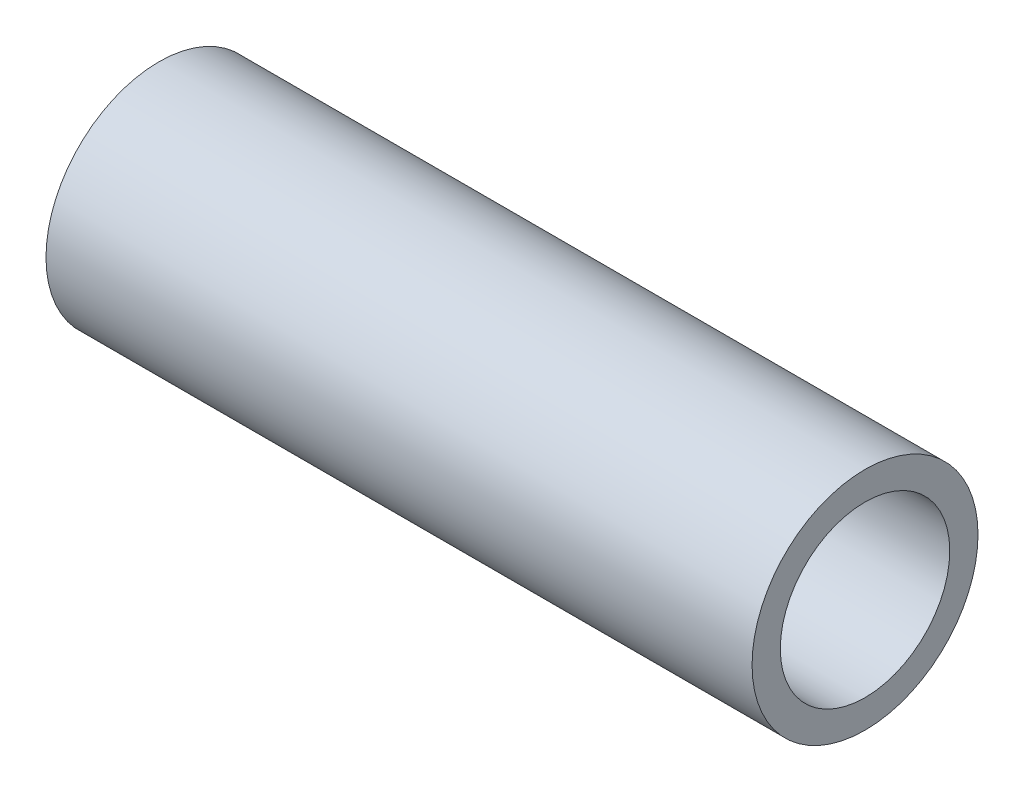
ISO-10303-21;
HEADER;
FILE_DESCRIPTION(('STEP AP214'),'2;1');
FILE_NAME('part.step','',(''),(''),'','','');
FILE_SCHEMA(('AUTOMOTIVE_DESIGN { 1 0 10303 214 1 1 1 1 }'));
ENDSEC;
DATA;
#1=APPLICATION_CONTEXT('core data for automotive mechanical design processes');
#2=APPLICATION_PROTOCOL_DEFINITION('international standard','automotive_design',2000,#1);
#3=PRODUCT_CONTEXT('',#1,'mechanical');
#4=PRODUCT('Part','Part','',(#3));
#5=PRODUCT_RELATED_PRODUCT_CATEGORY('part','',(#4));
#6=PRODUCT_DEFINITION_FORMATION('','',#4);
#7=PRODUCT_DEFINITION_CONTEXT('part definition',#1,'design');
#8=PRODUCT_DEFINITION('design','',#6,#7);
#9=PRODUCT_DEFINITION_SHAPE('','',#8);
#10=(LENGTH_UNIT() NAMED_UNIT(*) SI_UNIT(.MILLI.,.METRE.));
#11=(NAMED_UNIT(*) PLANE_ANGLE_UNIT() SI_UNIT($,.RADIAN.));
#12=(NAMED_UNIT(*) SI_UNIT($,.STERADIAN.) SOLID_ANGLE_UNIT());
#13=UNCERTAINTY_MEASURE_WITH_UNIT(LENGTH_MEASURE(1.E-05),#10,'distance_accuracy_value','');
#14=(GEOMETRIC_REPRESENTATION_CONTEXT(3) GLOBAL_UNCERTAINTY_ASSIGNED_CONTEXT((#13)) GLOBAL_UNIT_ASSIGNED_CONTEXT((#10,
#11,#12)) REPRESENTATION_CONTEXT('',''));
#15=CARTESIAN_POINT('',(0.,0.,0.));
#16=DIRECTION('',(0.,0.,1.));
#17=DIRECTION('',(1.,0.,0.));
#18=AXIS2_PLACEMENT_3D('',#15,#16,#17);
#19=CARTESIAN_POINT('',(12.5,0.,0.));
#20=DIRECTION('',(1.,0.,0.));
#21=DIRECTION('',(0.,0.,-1.));
#22=AXIS2_PLACEMENT_3D('',#19,#20,#21);
#23=PLANE('',#22);
#24=CARTESIAN_POINT('',(12.5,0.,0.));
#25=DIRECTION('',(1.,0.,0.));
#26=DIRECTION('',(0.,0.,-1.));
#27=AXIS2_PLACEMENT_3D('',#24,#25,#26);
#28=CIRCLE('',#27,2.);
#29=CARTESIAN_POINT('',(12.5,0.,-2.));
#30=VERTEX_POINT('',#29);
#31=EDGE_CURVE('E10',#30,#30,#28,.T.);
#32=ORIENTED_EDGE('',*,*,#31,.T.);
#33=EDGE_LOOP('',(#32));
#34=FACE_BOUND('',#33,.T.);
#35=CARTESIAN_POINT('',(12.5,0.,0.));
#36=DIRECTION('',(1.,0.,0.));
#37=DIRECTION('',(0.,0.,-1.));
#38=AXIS2_PLACEMENT_3D('',#35,#36,#37);
#39=CIRCLE('',#38,1.5);
#40=CARTESIAN_POINT('',(12.5,0.,-1.5));
#41=VERTEX_POINT('',#40);
#42=EDGE_CURVE('E54',#41,#41,#39,.T.);
#43=ORIENTED_EDGE('',*,*,#42,.F.);
#44=EDGE_LOOP('',(#43));
#45=FACE_BOUND('',#44,.T.);
#46=ADVANCED_FACE('F41',(#34,#45),#23,.T.);
#47=CARTESIAN_POINT('',(0.,0.,0.));
#48=DIRECTION('',(1.,0.,0.));
#49=DIRECTION('',(0.,0.,-1.));
#50=AXIS2_PLACEMENT_3D('',#47,#48,#49);
#51=PLANE('',#50);
#52=CARTESIAN_POINT('',(0.,0.,0.));
#53=DIRECTION('',(1.,0.,0.));
#54=DIRECTION('',(0.,0.,-1.));
#55=AXIS2_PLACEMENT_3D('',#52,#53,#54);
#56=CIRCLE('',#55,2.);
#57=CARTESIAN_POINT('',(0.,0.,-2.));
#58=VERTEX_POINT('',#57);
#59=EDGE_CURVE('E45',#58,#58,#56,.T.);
#60=ORIENTED_EDGE('',*,*,#59,.F.);
#61=EDGE_LOOP('',(#60));
#62=FACE_BOUND('',#61,.T.);
#63=CARTESIAN_POINT('',(0.,0.,0.));
#64=DIRECTION('',(1.,0.,0.));
#65=DIRECTION('',(0.,0.,-1.));
#66=AXIS2_PLACEMENT_3D('',#63,#64,#65);
#67=CIRCLE('',#66,1.5);
#68=CARTESIAN_POINT('',(0.,0.,-1.5));
#69=VERTEX_POINT('',#68);
#70=EDGE_CURVE('E56',#69,#69,#67,.T.);
#71=ORIENTED_EDGE('',*,*,#70,.T.);
#72=EDGE_LOOP('',(#71));
#73=FACE_BOUND('',#72,.T.);
#74=ADVANCED_FACE('F68',(#62,#73),#51,.F.);
#75=CARTESIAN_POINT('',(12.5,0.,0.));
#76=DIRECTION('',(-1.,0.,0.));
#77=DIRECTION('',(0.,0.,1.));
#78=AXIS2_PLACEMENT_3D('',#75,#76,#77);
#79=CYLINDRICAL_SURFACE('',#78,2.);
#80=ORIENTED_EDGE('',*,*,#31,.F.);
#81=EDGE_LOOP('',(#80));
#82=FACE_BOUND('',#81,.T.);
#83=ORIENTED_EDGE('',*,*,#59,.T.);
#84=EDGE_LOOP('',(#83));
#85=FACE_BOUND('',#84,.T.);
#86=ADVANCED_FACE('F43',(#82,#85),#79,.T.);
#87=CARTESIAN_POINT('',(12.5,0.,0.));
#88=DIRECTION('',(-1.,0.,0.));
#89=DIRECTION('',(0.,0.,1.));
#90=AXIS2_PLACEMENT_3D('',#87,#88,#89);
#91=CYLINDRICAL_SURFACE('',#90,1.5);
#92=ORIENTED_EDGE('',*,*,#42,.T.);
#93=EDGE_LOOP('',(#92));
#94=FACE_BOUND('',#93,.T.);
#95=ORIENTED_EDGE('',*,*,#70,.F.);
#96=EDGE_LOOP('',(#95));
#97=FACE_BOUND('',#96,.T.);
#98=ADVANCED_FACE('F64',(#94,#97),#91,.F.);
#99=CLOSED_SHELL('',(#46,#74,#86,#98));
#100=MANIFOLD_SOLID_BREP('B2',#99);
#101=ADVANCED_BREP_SHAPE_REPRESENTATION('',(#18,#100),#14);
#102=SHAPE_DEFINITION_REPRESENTATION(#9,#101);
ENDSEC;
END-ISO-10303-21;
